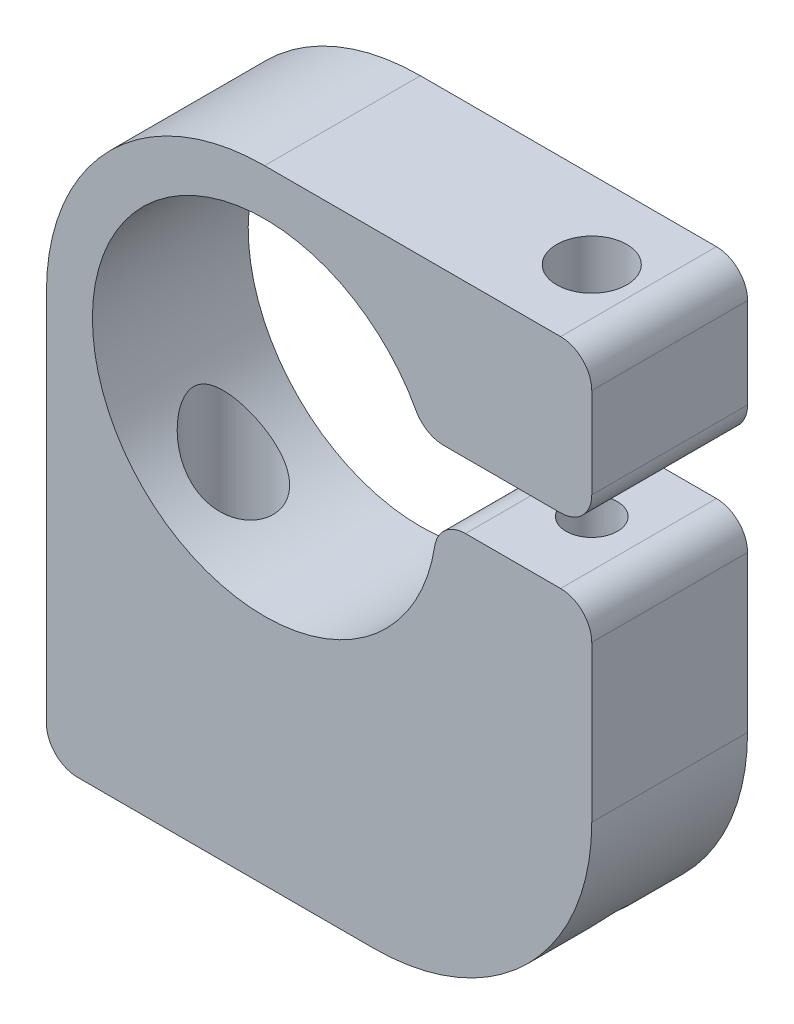
ISO-10303-21;
HEADER;
FILE_DESCRIPTION(('STEP AP214'),'2;1');
FILE_NAME('part.step','',(''),(''),'','','');
FILE_SCHEMA(('AUTOMOTIVE_DESIGN { 1 0 10303 214 1 1 1 1 }'));
ENDSEC;
DATA;
#1=APPLICATION_CONTEXT('core data for automotive mechanical design processes');
#2=APPLICATION_PROTOCOL_DEFINITION('international standard','automotive_design',2000,#1);
#3=PRODUCT_CONTEXT('',#1,'mechanical');
#4=PRODUCT('Part','Part','',(#3));
#5=PRODUCT_RELATED_PRODUCT_CATEGORY('part','',(#4));
#6=PRODUCT_DEFINITION_FORMATION('','',#4);
#7=PRODUCT_DEFINITION_CONTEXT('part definition',#1,'design');
#8=PRODUCT_DEFINITION('design','',#6,#7);
#9=PRODUCT_DEFINITION_SHAPE('','',#8);
#10=(LENGTH_UNIT() NAMED_UNIT(*) SI_UNIT(.MILLI.,.METRE.));
#11=(NAMED_UNIT(*) PLANE_ANGLE_UNIT() SI_UNIT($,.RADIAN.));
#12=(NAMED_UNIT(*) SI_UNIT($,.STERADIAN.) SOLID_ANGLE_UNIT());
#13=UNCERTAINTY_MEASURE_WITH_UNIT(LENGTH_MEASURE(1.E-05),#10,'distance_accuracy_value','');
#14=(GEOMETRIC_REPRESENTATION_CONTEXT(3) GLOBAL_UNCERTAINTY_ASSIGNED_CONTEXT((#13)) GLOBAL_UNIT_ASSIGNED_CONTEXT((#10,
#11,#12)) REPRESENTATION_CONTEXT('',''));
#15=CARTESIAN_POINT('',(0.,0.,0.));
#16=DIRECTION('',(0.,0.,1.));
#17=DIRECTION('',(1.,0.,0.));
#18=AXIS2_PLACEMENT_3D('',#15,#16,#17);
#19=CARTESIAN_POINT('',(-14.,-26.,10.));
#20=DIRECTION('',(0.,1.,0.));
#21=DIRECTION('',(-1.,0.,0.));
#22=AXIS2_PLACEMENT_3D('',#19,#20,#21);
#23=PLANE('',#22);
#24=DIRECTION('',(1.,0.,0.));
#25=VECTOR('',#24,1.);
#26=CARTESIAN_POINT('',(-14.,-26.,10.));
#27=LINE('',#26,#25);
#28=CARTESIAN_POINT('',(-12.,-26.,10.));
#29=VERTEX_POINT('',#28);
#30=CARTESIAN_POINT('',(7.,-26.,10.));
#31=VERTEX_POINT('',#30);
#32=EDGE_CURVE('E182',#29,#31,#27,.T.);
#33=ORIENTED_EDGE('',*,*,#32,.F.);
#34=DIRECTION('',(0.,0.,-1.));
#35=VECTOR('',#34,1.);
#36=CARTESIAN_POINT('',(-12.,-26.,10.));
#37=LINE('',#36,#35);
#38=CARTESIAN_POINT('',(-12.,-26.,0.));
#39=VERTEX_POINT('',#38);
#40=EDGE_CURVE('E174',#29,#39,#37,.T.);
#41=ORIENTED_EDGE('',*,*,#40,.T.);
#42=DIRECTION('',(1.,0.,0.));
#43=VECTOR('',#42,1.);
#44=CARTESIAN_POINT('',(-14.,-26.,0.));
#45=LINE('',#44,#43);
#46=CARTESIAN_POINT('',(7.,-26.,0.));
#47=VERTEX_POINT('',#46);
#48=EDGE_CURVE('E210',#39,#47,#45,.T.);
#49=ORIENTED_EDGE('',*,*,#48,.T.);
#50=DIRECTION('',(0.,0.,-1.));
#51=VECTOR('',#50,1.);
#52=CARTESIAN_POINT('',(7.,-26.,10.));
#53=LINE('',#52,#51);
#54=EDGE_CURVE('E222',#31,#47,#53,.T.);
#55=ORIENTED_EDGE('',*,*,#54,.F.);
#56=EDGE_LOOP('',(#33,#41,#49,#55));
#57=FACE_BOUND('',#56,.T.);
#58=CARTESIAN_POINT('',(-7.,-26.,5.));
#59=DIRECTION('',(0.,-1.,0.));
#60=DIRECTION('',(0.,0.,-1.));
#61=AXIS2_PLACEMENT_3D('',#58,#59,#60);
#62=CIRCLE('',#61,2.55269999999999);
#63=CARTESIAN_POINT('',(-7.,-26.,2.44730000000001));
#64=VERTEX_POINT('',#63);
#65=EDGE_CURVE('E409',#64,#64,#62,.T.);
#66=ORIENTED_EDGE('',*,*,#65,.F.);
#67=EDGE_LOOP('',(#66));
#68=FACE_BOUND('',#67,.T.);
#69=ADVANCED_FACE('F38',(#57,#68),#23,.F.);
#70=CARTESIAN_POINT('',(0.,14.,10.));
#71=DIRECTION('',(0.,-1.,0.));
#72=DIRECTION('',(0.,0.,-1.));
#73=AXIS2_PLACEMENT_3D('',#70,#71,#72);
#74=PLANE('',#73);
#75=DIRECTION('',(-1.,0.,0.));
#76=VECTOR('',#75,1.);
#77=CARTESIAN_POINT('',(0.,14.,10.));
#78=LINE('',#77,#76);
#79=CARTESIAN_POINT('',(19.,14.,10.));
#80=VERTEX_POINT('',#79);
#81=CARTESIAN_POINT('',(0.,14.,10.));
#82=VERTEX_POINT('',#81);
#83=EDGE_CURVE('E151',#80,#82,#78,.T.);
#84=ORIENTED_EDGE('',*,*,#83,.F.);
#85=DIRECTION('',(0.,0.,-1.));
#86=VECTOR('',#85,1.);
#87=CARTESIAN_POINT('',(19.,14.,10.));
#88=LINE('',#87,#86);
#89=CARTESIAN_POINT('',(19.,14.,0.));
#90=VERTEX_POINT('',#89);
#91=EDGE_CURVE('E335',#80,#90,#88,.T.);
#92=ORIENTED_EDGE('',*,*,#91,.T.);
#93=DIRECTION('',(-1.,0.,0.));
#94=VECTOR('',#93,1.);
#95=CARTESIAN_POINT('',(0.,14.,0.));
#96=LINE('',#95,#94);
#97=CARTESIAN_POINT('',(0.,14.,0.));
#98=VERTEX_POINT('',#97);
#99=EDGE_CURVE('E171',#90,#98,#96,.T.);
#100=ORIENTED_EDGE('',*,*,#99,.T.);
#101=DIRECTION('',(0.,0.,-1.));
#102=VECTOR('',#101,1.);
#103=CARTESIAN_POINT('',(0.,14.,10.));
#104=LINE('',#103,#102);
#105=EDGE_CURVE('E167',#82,#98,#104,.T.);
#106=ORIENTED_EDGE('',*,*,#105,.F.);
#107=EDGE_LOOP('',(#84,#92,#100,#106));
#108=FACE_BOUND('',#107,.T.);
#109=CARTESIAN_POINT('',(16.,14.,5.));
#110=DIRECTION('',(0.,1.,0.));
#111=DIRECTION('',(0.,0.,1.));
#112=AXIS2_PLACEMENT_3D('',#109,#110,#111);
#113=CIRCLE('',#112,2.24999999999999);
#114=CARTESIAN_POINT('',(16.,14.,7.24999999999999));
#115=VERTEX_POINT('',#114);
#116=EDGE_CURVE('E233',#115,#115,#113,.T.);
#117=ORIENTED_EDGE('',*,*,#116,.F.);
#118=EDGE_LOOP('',(#117));
#119=FACE_BOUND('',#118,.T.);
#120=ADVANCED_FACE('F168',(#108,#119),#74,.F.);
#121=CARTESIAN_POINT('',(0.,0.,10.));
#122=DIRECTION('',(0.,0.,-1.));
#123=DIRECTION('',(-1.,0.,0.));
#124=AXIS2_PLACEMENT_3D('',#121,#122,#123);
#125=CYLINDRICAL_SURFACE('',#124,11.05);
#126=CARTESIAN_POINT('',(-7.,-8.55,2.44730000000001));
#127=CARTESIAN_POINT('',(-6.91582227338061,-8.61891828092929,2.44730021930321));
#128=CARTESIAN_POINT('',(-6.83062757103432,-8.68658699889326,2.45146234715399));
#129=CARTESIAN_POINT('',(-6.65885844341236,-8.81894832773256,2.4687261767411));
#130=CARTESIAN_POINT('',(-6.57228447592739,-8.88364189947576,2.48182497029568));
#131=CARTESIAN_POINT('',(-6.3986080535741,-9.00953967894818,2.51757036820023));
#132=CARTESIAN_POINT('',(-6.3115058850438,-9.07074561769593,2.54021218836283));
#133=CARTESIAN_POINT('',(-6.13784335694778,-9.18914768532718,2.59557241929037));
#134=CARTESIAN_POINT('',(-6.05128276573991,-9.2463456529749,2.6282861716356));
#135=CARTESIAN_POINT('',(-5.84259248200227,-9.38018480640999,2.72080110255312));
#136=CARTESIAN_POINT('',(-5.72135326767104,-9.45447301355489,2.78619561321113));
#137=CARTESIAN_POINT('',(-5.48710248455832,-9.59232513224943,2.93918277873381));
#138=CARTESIAN_POINT('',(-5.37408534080165,-9.65589634971606,3.02676020844699));
#139=CARTESIAN_POINT('',(-5.16072212371146,-9.77160560888942,3.22389980728585));
#140=CARTESIAN_POINT('',(-5.0604506762834,-9.82367752342953,3.33358253091881));
#141=CARTESIAN_POINT('',(-4.87867755337641,-9.91521124980694,3.57215994244326));
#142=CARTESIAN_POINT('',(-4.79717043001752,-9.9546767229878,3.70104903616756));
#143=CARTESIAN_POINT('',(-4.66444990013896,-10.0174987368244,3.9604812249715));
#144=CARTESIAN_POINT('',(-4.611046451206,-10.0420572971666,4.08961673616397));
#145=CARTESIAN_POINT('',(-4.52583543818812,-10.0807503937009,4.35629465045988));
#146=CARTESIAN_POINT('',(-4.49401982510529,-10.0948888151986,4.49383389936745));
#147=CARTESIAN_POINT('',(-4.45464254131906,-10.1123238524974,4.76511458296565));
#148=CARTESIAN_POINT('',(-4.44582659487551,-10.1161814048369,4.89863970576941));
#149=CARTESIAN_POINT('',(-4.44917462901911,-10.1147096597553,5.16536543958354));
#150=CARTESIAN_POINT('',(-4.46133533829391,-10.1093817948013,5.29856609795018));
#151=CARTESIAN_POINT('',(-4.50578803655468,-10.0896453817462,5.55891009600437));
#152=CARTESIAN_POINT('',(-4.53779375226787,-10.0753659325654,5.68611236277468));
#153=CARTESIAN_POINT('',(-4.62032539498195,-10.0377853303976,5.93293024560929));
#154=CARTESIAN_POINT('',(-4.67085096260623,-10.0144843524722,6.05254600883639));
#155=CARTESIAN_POINT('',(-4.78909182279992,-9.95848444657918,6.28261833109357));
#156=CARTESIAN_POINT('',(-4.85702410909894,-9.92566613883106,6.39293400598795));
#157=CARTESIAN_POINT('',(-5.00691855343983,-9.85090169234285,6.60008100643447));
#158=CARTESIAN_POINT('',(-5.08888261614623,-9.80895431421851,6.69691049814028));
#159=CARTESIAN_POINT('',(-5.26778917821294,-9.71409279963231,6.87958270744378));
#160=CARTESIAN_POINT('',(-5.36525732003787,-9.66075326084558,6.96468760788155));
#161=CARTESIAN_POINT('',(-5.5683128171784,-9.54515843513311,7.11723804954233));
#162=CARTESIAN_POINT('',(-5.67390214087097,-9.48290098354882,7.18467929196429));
#163=CARTESIAN_POINT('',(-5.90047685231445,-9.34377960210155,7.30771661305881));
#164=CARTESIAN_POINT('',(-6.02194816668489,-9.26607844806306,7.36146362377749));
#165=CARTESIAN_POINT('',(-6.26661487830976,-9.10240593239786,7.44853562475557));
#166=CARTESIAN_POINT('',(-6.38981168508661,-9.01642742637117,7.48184278666938));
#167=CARTESIAN_POINT('',(-6.68729766332038,-8.79938837781169,7.53973292496556));
#168=CARTESIAN_POINT('',(-6.86091961227399,-8.66476534579487,7.55450318352895));
#169=CARTESIAN_POINT('',(-7.19943550850972,-8.38564269357662,7.55054006637053));
#170=CARTESIAN_POINT('',(-7.36432097278999,-8.241133775255,7.53177472039414));
#171=CARTESIAN_POINT('',(-7.68414769569538,-7.94384691266525,7.4648068548412));
#172=CARTESIAN_POINT('',(-7.83892408316011,-7.79098349947186,7.41620920043142));
#173=CARTESIAN_POINT('',(-8.13453173744894,-7.48182597649256,7.29235550809219));
#174=CARTESIAN_POINT('',(-8.27532669370793,-7.32552415852656,7.21703226611901));
#175=CARTESIAN_POINT('',(-8.48957492483989,-7.07427779779615,7.07531747375102));
#176=CARTESIAN_POINT('',(-8.56797995603815,-6.97902972810029,7.01677740008713));
#177=CARTESIAN_POINT('',(-8.71863027937125,-6.78988840431592,6.89005025630064));
#178=CARTESIAN_POINT('',(-8.79087114978904,-6.69599616224703,6.82185635293331));
#179=CARTESIAN_POINT('',(-8.92830276124916,-6.51161059184213,6.67569346560714));
#180=CARTESIAN_POINT('',(-8.99352479554179,-6.42110346016955,6.59777152811136));
#181=CARTESIAN_POINT('',(-9.11643655558932,-6.2453601356915,6.43097851812366));
#182=CARTESIAN_POINT('',(-9.17413846494606,-6.16011553787112,6.34212562103501));
#183=CARTESIAN_POINT('',(-9.26650263943499,-6.01992555464292,6.17713277247053));
#184=CARTESIAN_POINT('',(-9.30321342581972,-5.96294677193365,6.10388570170611));
#185=CARTESIAN_POINT('',(-9.37091023318427,-5.85598319569889,5.94981271437577));
#186=CARTESIAN_POINT('',(-9.40189341278976,-5.80600187647093,5.86898306602609));
#187=CARTESIAN_POINT('',(-9.45704052062065,-5.71574328017512,5.69813905099871));
#188=CARTESIAN_POINT('',(-9.48110233302485,-5.67561248462582,5.60801142498912));
#189=CARTESIAN_POINT('',(-9.51962893314093,-5.6107603174239,5.42048096383256));
#190=CARTESIAN_POINT('',(-9.53412688491903,-5.58598571420402,5.32310458635426));
#191=CARTESIAN_POINT('',(-9.54927357137649,-5.56003844308443,5.15107964124371));
#192=CARTESIAN_POINT('',(-9.55259565720213,-5.55431466774299,5.07734886713659));
#193=CARTESIAN_POINT('',(-9.55279927475475,-5.55396532930258,4.92984497289981));
#194=CARTESIAN_POINT('',(-9.5496816032385,-5.55933839325096,4.85607185913761));
#195=CARTESIAN_POINT('',(-9.53732309052223,-5.58051133249627,4.71092422137441));
#196=CARTESIAN_POINT('',(-9.52810667830438,-5.59626960799627,4.63954131681787));
#197=CARTESIAN_POINT('',(-9.50430624388253,-5.63659549260418,4.50026721442244));
#198=CARTESIAN_POINT('',(-9.48971751535205,-5.66117082525817,4.43237913778262));
#199=CARTESIAN_POINT('',(-9.44579705695876,-5.73429557275425,4.26090575121788));
#200=CARTESIAN_POINT('',(-9.4128877208385,-5.7883500232898,4.16060531557813));
#201=CARTESIAN_POINT('',(-9.33823866932467,-5.90802801501698,3.97073003865575));
#202=CARTESIAN_POINT('',(-9.2964707266068,-5.97368842362166,3.8811909515325));
#203=CARTESIAN_POINT('',(-9.21231919737082,-6.10252055153487,3.72379122107621));
#204=CARTESIAN_POINT('',(-9.17084356190511,-6.16474972776025,3.65465142351575));
#205=CARTESIAN_POINT('',(-9.08340501241976,-6.29287480515179,3.52285353776865));
#206=CARTESIAN_POINT('',(-9.03743894994673,-6.35877326490362,3.4602000617762));
#207=CARTESIAN_POINT('',(-8.9414062953461,-6.49311856814282,3.34075325452514));
#208=CARTESIAN_POINT('',(-8.89133185005283,-6.56157014904866,3.28397163848765));
#209=CARTESIAN_POINT('',(-8.78744798055969,-6.70005658777117,3.17601591523038));
#210=CARTESIAN_POINT('',(-8.73363759506631,-6.77009184993509,3.1248432600504));
#211=CARTESIAN_POINT('',(-8.60244306329082,-6.93652511015039,3.01039470720596));
#212=CARTESIAN_POINT('',(-8.52355597708609,-7.03332160347713,2.94940956694815));
#213=CARTESIAN_POINT('',(-8.35961023785898,-7.22741815906888,2.83722340193677));
#214=CARTESIAN_POINT('',(-8.27454892065696,-7.32471842169038,2.78602663590866));
#215=CARTESIAN_POINT('',(-8.09884148477037,-7.51853212462236,2.6937823022661));
#216=CARTESIAN_POINT('',(-8.00821196226968,-7.61504701661814,2.65270624381435));
#217=CARTESIAN_POINT('',(-7.82150872449019,-7.806689039355,2.58103407259278));
#218=CARTESIAN_POINT('',(-7.72543564048604,-7.90181632941012,2.5504367475206));
#219=CARTESIAN_POINT('',(-7.5270730715576,-8.09102521976024,2.50018625397325));
#220=CARTESIAN_POINT('',(-7.42472118659406,-8.18507914771044,2.48067376912764));
#221=CARTESIAN_POINT('',(-7.21547961375136,-8.37011703082066,2.45422484046178));
#222=CARTESIAN_POINT('',(-7.10858592951042,-8.46109815035985,2.44729971710758));
#223=CARTESIAN_POINT('',(-7.,-8.55,2.44730000000001));
#224=B_SPLINE_CURVE_WITH_KNOTS('',3,(#126,#127,#128,#129,#130,#131,#132,#133,#134,#135,#136,
#137,#138,#139,#140,#141,#142,#143,#144,#145,#146,#147,#148,#149,#150,#151,#152,#153,#154,#155,
#156,#157,#158,#159,#160,#161,#162,#163,#164,#165,#166,#167,#168,#169,#170,#171,#172,#173,#174,
#175,#176,#177,#178,#179,#180,#181,#182,#183,#184,#185,#186,#187,#188,#189,#190,#191,#192,#193,
#194,#195,#196,#197,#198,#199,#200,#201,#202,#203,#204,#205,#206,#207,#208,#209,#210,#211,#212,
#213,#214,#215,#216,#217,#218,#219,#220,#221,#222,#223),.UNSPECIFIED.,.T.,.F.,(4,2,2,2,2,2,2,2,
2,2,2,2,2,2,2,2,2,2,2,2,2,2,2,2,2,2,2,2,2,2,2,2,2,2,2,2,2,2,2,2,2,2,2,2,2,2,2,2,4),(0.,
0.326260761406683,0.65241540120872,0.978406724649654,1.30424749814308,1.77169449077878,
2.23882151842664,2.7085686030106,3.17817913259791,3.60163469955728,4.02493229474726,
4.42461053592038,4.8242264528516,5.21820769638648,5.61218129514414,6.01132784405462,
6.41052861588882,6.82864143584349,7.24685591748099,7.70672889132275,8.16700241432437,
8.82399382588616,9.4816118964522,10.1481340198454,10.8163441955908,11.2255925001434,
11.6351319438537,12.0427623941947,12.4497239943351,12.7485793995887,13.0475826667011,
13.3507942849023,13.6529488674638,13.8739736331243,14.0949710542095,14.3150885683233,
14.5353993731607,14.8891544241882,15.2440540965731,15.5491782562871,15.8545179099744,
16.1604554616674,16.4664720279053,16.8828515600978,17.299411840474,17.714785707201,
18.130111502378,18.5505969700523,18.9714604153234),.UNSPECIFIED.);
#225=CARTESIAN_POINT('',(-7.,-8.55,2.44730000000001));
#226=VERTEX_POINT('',#225);
#227=EDGE_CURVE('E404',#226,#226,#224,.T.);
#228=ORIENTED_EDGE('',*,*,#227,.T.);
#229=EDGE_LOOP('',(#228));
#230=FACE_BOUND('',#229,.T.);
#231=CARTESIAN_POINT('',(0.,0.,10.));
#232=DIRECTION('',(0.,0.,-1.));
#233=DIRECTION('',(1.,0.,0.));
#234=AXIS2_PLACEMENT_3D('',#231,#232,#233);
#235=CIRCLE('',#234,11.05);
#236=CARTESIAN_POINT('',(10.9194598387173,-1.69348659003832,10.));
#237=VERTEX_POINT('',#236);
#238=CARTESIAN_POINT('',(9.72327164371918,5.24980842911877,10.));
#239=VERTEX_POINT('',#238);
#240=EDGE_CURVE('E219',#237,#239,#235,.T.);
#241=ORIENTED_EDGE('',*,*,#240,.F.);
#242=DIRECTION('',(0.,0.,-1.));
#243=VECTOR('',#242,1.);
#244=CARTESIAN_POINT('',(10.9194598387173,-1.69348659003832,10.));
#245=LINE('',#244,#243);
#246=CARTESIAN_POINT('',(10.9194598387173,-1.69348659003832,0.));
#247=VERTEX_POINT('',#246);
#248=EDGE_CURVE('E11',#237,#247,#245,.T.);
#249=ORIENTED_EDGE('',*,*,#248,.T.);
#250=CARTESIAN_POINT('',(0.,0.,0.));
#251=DIRECTION('',(0.,0.,-1.));
#252=DIRECTION('',(1.,0.,0.));
#253=AXIS2_PLACEMENT_3D('',#250,#251,#252);
#254=CIRCLE('',#253,11.05);
#255=CARTESIAN_POINT('',(9.72327164371918,5.24980842911877,0.));
#256=VERTEX_POINT('',#255);
#257=EDGE_CURVE('E194',#247,#256,#254,.T.);
#258=ORIENTED_EDGE('',*,*,#257,.T.);
#259=DIRECTION('',(0.,0.,-1.));
#260=VECTOR('',#259,1.);
#261=CARTESIAN_POINT('',(9.72327164371918,5.24980842911877,10.));
#262=LINE('',#261,#260);
#263=EDGE_CURVE('E46',#256,#239,#262,.F.);
#264=ORIENTED_EDGE('',*,*,#263,.T.);
#265=EDGE_LOOP('',(#241,#249,#258,#264));
#266=FACE_BOUND('',#265,.T.);
#267=ADVANCED_FACE('F275',(#230,#266),#125,.F.);
#268=CARTESIAN_POINT('',(10.2206898005957,4.2,10.));
#269=DIRECTION('',(0.,1.,0.));
#270=DIRECTION('',(0.,0.,1.));
#271=AXIS2_PLACEMENT_3D('',#268,#269,#270);
#272=PLANE('',#271);
#273=CARTESIAN_POINT('',(16.,4.2,5.));
#274=DIRECTION('',(0.,1.,0.));
#275=DIRECTION('',(0.,0.,1.));
#276=AXIS2_PLACEMENT_3D('',#273,#274,#275);
#277=CIRCLE('',#276,2.24999999999999);
#278=CARTESIAN_POINT('',(16.,4.2,7.24999999999999));
#279=VERTEX_POINT('',#278);
#280=EDGE_CURVE('E198',#279,#279,#277,.T.);
#281=ORIENTED_EDGE('',*,*,#280,.T.);
#282=EDGE_LOOP('',(#281));
#283=FACE_BOUND('',#282,.T.);
#284=DIRECTION('',(1.,0.,0.));
#285=VECTOR('',#284,1.);
#286=CARTESIAN_POINT('',(10.2206898005957,4.2,0.));
#287=LINE('',#286,#285);
#288=CARTESIAN_POINT('',(11.4831398145281,4.2,0.));
#289=VERTEX_POINT('',#288);
#290=CARTESIAN_POINT('',(19.,4.2,0.));
#291=VERTEX_POINT('',#290);
#292=EDGE_CURVE('E197',#289,#291,#287,.T.);
#293=ORIENTED_EDGE('',*,*,#292,.T.);
#294=DIRECTION('',(0.,0.,-1.));
#295=VECTOR('',#294,1.);
#296=CARTESIAN_POINT('',(19.,4.2,10.));
#297=LINE('',#296,#295);
#298=CARTESIAN_POINT('',(19.,4.2,10.));
#299=VERTEX_POINT('',#298);
#300=EDGE_CURVE('E345',#291,#299,#297,.F.);
#301=ORIENTED_EDGE('',*,*,#300,.T.);
#302=DIRECTION('',(1.,0.,0.));
#303=VECTOR('',#302,1.);
#304=CARTESIAN_POINT('',(10.2206898005957,4.2,10.));
#305=LINE('',#304,#303);
#306=CARTESIAN_POINT('',(11.4831398145281,4.2,10.));
#307=VERTEX_POINT('',#306);
#308=EDGE_CURVE('E358',#307,#299,#305,.T.);
#309=ORIENTED_EDGE('',*,*,#308,.F.);
#310=DIRECTION('',(0.,0.,-1.));
#311=VECTOR('',#310,1.);
#312=CARTESIAN_POINT('',(11.4831398145281,4.2,10.));
#313=LINE('',#312,#311);
#314=EDGE_CURVE('E342',#307,#289,#313,.T.);
#315=ORIENTED_EDGE('',*,*,#314,.T.);
#316=EDGE_LOOP('',(#293,#301,#309,#315));
#317=FACE_BOUND('',#316,.T.);
#318=ADVANCED_FACE('F288',(#283,#317),#272,.F.);
#319=CARTESIAN_POINT('',(21.,14.,10.));
#320=DIRECTION('',(-1.,0.,0.));
#321=DIRECTION('',(0.,0.,1.));
#322=AXIS2_PLACEMENT_3D('',#319,#320,#321);
#323=PLANE('',#322);
#324=DIRECTION('',(0.,1.,0.));
#325=VECTOR('',#324,1.);
#326=CARTESIAN_POINT('',(21.,14.,0.));
#327=LINE('',#326,#325);
#328=CARTESIAN_POINT('',(21.,6.2,0.));
#329=VERTEX_POINT('',#328);
#330=CARTESIAN_POINT('',(21.,12.,0.));
#331=VERTEX_POINT('',#330);
#332=EDGE_CURVE('E201',#329,#331,#327,.T.);
#333=ORIENTED_EDGE('',*,*,#332,.T.);
#334=DIRECTION('',(0.,0.,-1.));
#335=VECTOR('',#334,1.);
#336=CARTESIAN_POINT('',(21.,12.,10.));
#337=LINE('',#336,#335);
#338=CARTESIAN_POINT('',(21.,12.,10.));
#339=VERTEX_POINT('',#338);
#340=EDGE_CURVE('E340',#331,#339,#337,.F.);
#341=ORIENTED_EDGE('',*,*,#340,.T.);
#342=DIRECTION('',(0.,1.,0.));
#343=VECTOR('',#342,1.);
#344=CARTESIAN_POINT('',(21.,14.,10.));
#345=LINE('',#344,#343);
#346=CARTESIAN_POINT('',(21.,6.2,10.));
#347=VERTEX_POINT('',#346);
#348=EDGE_CURVE('E164',#347,#339,#345,.T.);
#349=ORIENTED_EDGE('',*,*,#348,.F.);
#350=DIRECTION('',(0.,0.,-1.));
#351=VECTOR('',#350,1.);
#352=CARTESIAN_POINT('',(21.,6.2,10.));
#353=LINE('',#352,#351);
#354=EDGE_CURVE('E337',#347,#329,#353,.T.);
#355=ORIENTED_EDGE('',*,*,#354,.T.);
#356=EDGE_LOOP('',(#333,#341,#349,#355));
#357=FACE_BOUND('',#356,.T.);
#358=ADVANCED_FACE('F284',(#357),#323,.F.);
#359=CARTESIAN_POINT('',(0.,0.,10.));
#360=DIRECTION('',(0.,0.,-1.));
#361=DIRECTION('',(-1.,0.,0.));
#362=AXIS2_PLACEMENT_3D('',#359,#360,#361);
#363=CYLINDRICAL_SURFACE('',#362,14.);
#364=CARTESIAN_POINT('',(0.,0.,0.));
#365=DIRECTION('',(0.,0.,1.));
#366=DIRECTION('',(1.,0.,0.));
#367=AXIS2_PLACEMENT_3D('',#364,#365,#366);
#368=CIRCLE('',#367,14.);
#369=CARTESIAN_POINT('',(-14.,0.,0.));
#370=VERTEX_POINT('',#369);
#371=EDGE_CURVE('E205',#98,#370,#368,.T.);
#372=ORIENTED_EDGE('',*,*,#371,.T.);
#373=DIRECTION('',(0.,0.,-1.));
#374=VECTOR('',#373,1.);
#375=CARTESIAN_POINT('',(-14.,0.,10.));
#376=LINE('',#375,#374);
#377=CARTESIAN_POINT('',(-14.,0.,10.));
#378=VERTEX_POINT('',#377);
#379=EDGE_CURVE('E175',#378,#370,#376,.T.);
#380=ORIENTED_EDGE('',*,*,#379,.F.);
#381=CARTESIAN_POINT('',(0.,0.,10.));
#382=DIRECTION('',(0.,0.,1.));
#383=DIRECTION('',(1.,0.,0.));
#384=AXIS2_PLACEMENT_3D('',#381,#382,#383);
#385=CIRCLE('',#384,14.);
#386=EDGE_CURVE('E156',#82,#378,#385,.T.);
#387=ORIENTED_EDGE('',*,*,#386,.F.);
#388=ORIENTED_EDGE('',*,*,#105,.T.);
#389=EDGE_LOOP('',(#372,#380,#387,#388));
#390=FACE_BOUND('',#389,.T.);
#391=ADVANCED_FACE('F177',(#390),#363,.T.);
#392=CARTESIAN_POINT('',(-14.,0.,10.));
#393=DIRECTION('',(1.,0.,0.));
#394=DIRECTION('',(0.,1.,0.));
#395=AXIS2_PLACEMENT_3D('',#392,#393,#394);
#396=PLANE('',#395);
#397=DIRECTION('',(0.,-1.,0.));
#398=VECTOR('',#397,1.);
#399=CARTESIAN_POINT('',(-14.,0.,0.));
#400=LINE('',#399,#398);
#401=CARTESIAN_POINT('',(-14.,-24.,0.));
#402=VERTEX_POINT('',#401);
#403=EDGE_CURVE('E207',#370,#402,#400,.T.);
#404=ORIENTED_EDGE('',*,*,#403,.T.);
#405=DIRECTION('',(0.,0.,-1.));
#406=VECTOR('',#405,1.);
#407=CARTESIAN_POINT('',(-14.,-24.,10.));
#408=LINE('',#407,#406);
#409=CARTESIAN_POINT('',(-14.,-24.,10.));
#410=VERTEX_POINT('',#409);
#411=EDGE_CURVE('E327',#402,#410,#408,.F.);
#412=ORIENTED_EDGE('',*,*,#411,.T.);
#413=DIRECTION('',(0.,-1.,0.));
#414=VECTOR('',#413,1.);
#415=CARTESIAN_POINT('',(-14.,0.,10.));
#416=LINE('',#415,#414);
#417=EDGE_CURVE('E180',#378,#410,#416,.T.);
#418=ORIENTED_EDGE('',*,*,#417,.F.);
#419=ORIENTED_EDGE('',*,*,#379,.T.);
#420=EDGE_LOOP('',(#404,#412,#418,#419));
#421=FACE_BOUND('',#420,.T.);
#422=ADVANCED_FACE('F268',(#421),#396,.F.);
#423=CARTESIAN_POINT('',(7.,-12.,10.));
#424=DIRECTION('',(0.,0.,-1.));
#425=DIRECTION('',(-1.,0.,0.));
#426=AXIS2_PLACEMENT_3D('',#423,#424,#425);
#427=CYLINDRICAL_SURFACE('',#426,14.);
#428=CARTESIAN_POINT('',(16.,-22.7238052947636,6.64999999999999));
#429=CARTESIAN_POINT('',(16.106579995657,-22.6343528788209,6.64999937148087));
#430=CARTESIAN_POINT('',(16.2119257461119,-22.5432118765201,6.63967861318019));
#431=CARTESIAN_POINT('',(16.4180467313716,-22.3595182425853,6.59963227004351));
#432=CARTESIAN_POINT('',(16.5188040136965,-22.2669616914375,6.56983647814548));
#433=CARTESIAN_POINT('',(16.7296204153312,-22.0677029799706,6.48495127735594));
#434=CARTESIAN_POINT('',(16.838534085899,-21.9611437664043,6.42654086662092));
#435=CARTESIAN_POINT('',(16.9925416717458,-21.8058394712143,6.31956531374991));
#436=CARTESIAN_POINT('',(17.0422908469139,-21.7548554447352,6.28070833711339));
#437=CARTESIAN_POINT('',(17.1381930128919,-21.6551438139479,6.19628381873392));
#438=CARTESIAN_POINT('',(17.1843487882394,-21.6064144745977,6.15072155369636));
#439=CARTESIAN_POINT('',(17.2783623633107,-21.505820560723,6.04589745921177));
#440=CARTESIAN_POINT('',(17.3256017274291,-21.4544273622782,5.98561567077288));
#441=CARTESIAN_POINT('',(17.4130229101965,-21.3580538185622,5.85556197975288));
#442=CARTESIAN_POINT('',(17.4532162560941,-21.3130630221341,5.78580591529059));
#443=CARTESIAN_POINT('',(17.5168278214362,-21.2411110596542,5.65264859046648));
#444=CARTESIAN_POINT('',(17.5419954205956,-21.2123513694785,5.59107061879283));
#445=CARTESIAN_POINT('',(17.585301804171,-21.1625584802104,5.46250049247954));
#446=CARTESIAN_POINT('',(17.6034459883031,-21.1415193460781,5.39551254520185));
#447=CARTESIAN_POINT('',(17.6314476646167,-21.1089406996459,5.25676296801894));
#448=CARTESIAN_POINT('',(17.6412187369708,-21.0975002814021,5.18495961288801));
#449=CARTESIAN_POINT('',(17.6511178429677,-21.0859098208405,5.03980664908665));
#450=CARTESIAN_POINT('',(17.6512551491392,-21.0857489219516,4.96645859523165));
#451=CARTESIAN_POINT('',(17.6426376062661,-21.0958389663479,4.83256517356608));
#452=CARTESIAN_POINT('',(17.6352567218856,-21.1044811347259,4.77179643157314));
#453=CARTESIAN_POINT('',(17.6142055671432,-21.1290142083835,4.65288206187813));
#454=CARTESIAN_POINT('',(17.6005320775243,-21.1449088239337,4.59473779357945));
#455=CARTESIAN_POINT('',(17.5624508106396,-21.1888909447278,4.46404308010366));
#456=CARTESIAN_POINT('',(17.5360064105836,-21.2192544144082,4.3928576980767));
#457=CARTESIAN_POINT('',(17.4755622207263,-21.2878789044817,4.25790011605861));
#458=CARTESIAN_POINT('',(17.4415472331647,-21.3261557997266,4.19414322642238));
#459=CARTESIAN_POINT('',(17.3516546333627,-21.4259985314055,4.04831655959411));
#460=CARTESIAN_POINT('',(17.2926701141167,-21.490495157725,3.97018382795625));
#461=CARTESIAN_POINT('',(17.1658023020504,-21.6262751411015,3.82847261657362));
#462=CARTESIAN_POINT('',(17.0979021974435,-21.6975712483798,3.7649222723929));
#463=CARTESIAN_POINT('',(16.9306282045901,-21.8692160310444,3.63199314975953));
#464=CARTESIAN_POINT('',(16.8284618473636,-21.9711225684204,3.56812840492811));
#465=CARTESIAN_POINT('',(16.6148392283032,-22.1772779488726,3.46423246623702));
#466=CARTESIAN_POINT('',(16.503375559846,-22.2815286101437,3.42422048523059));
#467=CARTESIAN_POINT('',(16.2725136876682,-22.4902307103248,3.36828871405738));
#468=CARTESIAN_POINT('',(16.1530454690731,-22.5946731177538,3.35262182383202));
#469=CARTESIAN_POINT('',(15.9102997798279,-22.7996148734929,3.34798619096338));
#470=CARTESIAN_POINT('',(15.7870273212754,-22.9001190446257,3.35898368585487));
#471=CARTESIAN_POINT('',(15.5683082068592,-23.0724434166654,3.40447682209039));
#472=CARTESIAN_POINT('',(15.4727686603442,-23.1456728306208,3.43320431295187));
#473=CARTESIAN_POINT('',(15.2848376247068,-23.2860598659466,3.5095979619181));
#474=CARTESIAN_POINT('',(15.1924421379826,-23.3532253920164,3.5572390142285));
#475=CARTESIAN_POINT('',(15.0303250024325,-23.4683034433074,3.66215117836996));
#476=CARTESIAN_POINT('',(14.9594782446716,-23.5175224394325,3.71624246384423));
#477=CARTESIAN_POINT('',(14.8252018301674,-23.6091693892466,3.83787167745971));
#478=CARTESIAN_POINT('',(14.7617708405492,-23.6515985638132,3.90540718328483));
#479=CARTESIAN_POINT('',(14.644995971895,-23.7285540646411,4.05372484201149));
#480=CARTESIAN_POINT('',(14.5917337644027,-23.763016837769,4.13460525460281));
#481=CARTESIAN_POINT('',(14.4992695054021,-23.8221823401396,4.307274701436));
#482=CARTESIAN_POINT('',(14.4600548170354,-23.8468938434667,4.39905383193368));
#483=CARTESIAN_POINT('',(14.4027709378073,-23.8827592103645,4.5770689462531));
#484=CARTESIAN_POINT('',(14.3825342307727,-23.8953109696735,4.66232922454683));
#485=CARTESIAN_POINT('',(14.3558550360406,-23.9118283349687,4.83577890948328));
#486=CARTESIAN_POINT('',(14.3494036687769,-23.9157994680218,4.92396639341754));
#487=CARTESIAN_POINT('',(14.3506264730563,-23.9150443225192,5.09217421626688));
#488=CARTESIAN_POINT('',(14.3570740049052,-23.9110733227628,5.17221073180531));
#489=CARTESIAN_POINT('',(14.3813397959637,-23.8960507929753,5.32984052704268));
#490=CARTESIAN_POINT('',(14.3991564194326,-23.8850002815159,5.4074341565296));
#491=CARTESIAN_POINT('',(14.4451782729215,-23.8562239414615,5.55785155767265));
#492=CARTESIAN_POINT('',(14.4733487279084,-23.8385204535525,5.63069034581051));
#493=CARTESIAN_POINT('',(14.5387817088008,-23.7969600737915,5.77025057906279));
#494=CARTESIAN_POINT('',(14.5760463018198,-23.7731017828715,5.8369706286268));
#495=CARTESIAN_POINT('',(14.6610769858981,-23.7179621514858,5.96761825304297));
#496=CARTESIAN_POINT('',(14.7094022679763,-23.6862729319695,6.03100783484434));
#497=CARTESIAN_POINT('',(14.812811523411,-23.6173937112617,6.14857366407959));
#498=CARTESIAN_POINT('',(14.8678977855172,-23.5802018464159,6.20274677663263));
#499=CARTESIAN_POINT('',(14.9906775601817,-23.4958825367302,6.30810999763578));
#500=CARTESIAN_POINT('',(15.0590735934271,-23.4480915506242,6.35794660865051));
#501=CARTESIAN_POINT('',(15.1999497072863,-23.3476133372229,6.44544422256679));
#502=CARTESIAN_POINT('',(15.2724334674585,-23.2949216699785,6.48309404331672));
#503=CARTESIAN_POINT('',(15.4329063596069,-23.175767946371,6.55237397116199));
#504=CARTESIAN_POINT('',(15.5213259970159,-23.1085403369733,6.58167863768683));
#505=CARTESIAN_POINT('',(15.6987021618737,-22.9701967243639,6.62482162473554));
#506=CARTESIAN_POINT('',(15.7876581212651,-22.8990843512463,6.63867413363013));
#507=CARTESIAN_POINT('',(15.9174707395229,-22.7926653857343,6.64846038537193));
#508=CARTESIAN_POINT('',(15.9588274645974,-22.7583613363504,6.65000024280096));
#509=CARTESIAN_POINT('',(16.,-22.7238052947636,6.64999999999999));
#510=B_SPLINE_CURVE_WITH_KNOTS('',3,(#428,#429,#430,#431,#432,#433,#434,#435,#436,#437,#438,
#439,#440,#441,#442,#443,#444,#445,#446,#447,#448,#449,#450,#451,#452,#453,#454,#455,#456,#457,
#458,#459,#460,#461,#462,#463,#464,#465,#466,#467,#468,#469,#470,#471,#472,#473,#474,#475,#476,
#477,#478,#479,#480,#481,#482,#483,#484,#485,#486,#487,#488,#489,#490,#491,#492,#493,#494,#495,
#496,#497,#498,#499,#500,#501,#502,#503,#504,#505,#506,#507,#508,#509),.UNSPECIFIED.,.T.,.F.,(4,
2,2,2,2,2,2,2,2,2,2,2,2,2,2,2,2,2,2,2,2,2,2,2,2,2,2,2,2,2,2,2,2,2,2,2,2,2,2,2,4),(0.,
0.417313624974774,0.836140015878179,1.32296089721767,1.56608888484299,1.80902655674804,
2.08491886679901,2.36035551850128,2.57698173153486,2.79344106643438,3.01210848279734,
3.23056542822633,3.41518674146972,3.59990261098669,3.84389778596581,4.08838726523621,
4.43816062529032,4.7886032748193,5.25958637148018,5.73094832341318,6.20717486613138,
6.68279872540552,7.05267387347715,7.42205968343826,7.72630485206907,8.03049525277731,
8.33703451641478,8.64329732703461,8.90740721526167,9.17134693074442,9.41137735393962,
9.65137325027696,9.89057033929166,10.1298218489503,10.3861262662991,10.6425176892374,
10.9329869020569,11.2237218881852,11.5671158037298,11.9101941503294,12.0714050782557),.UNSPECIFIED.);
#511=CARTESIAN_POINT('',(16.,-22.7238052947636,6.64999999999999));
#512=VERTEX_POINT('',#511);
#513=EDGE_CURVE('E226',#512,#512,#510,.T.);
#514=ORIENTED_EDGE('',*,*,#513,.T.);
#515=EDGE_LOOP('',(#514));
#516=FACE_BOUND('',#515,.T.);
#517=CARTESIAN_POINT('',(7.,-12.,0.));
#518=DIRECTION('',(0.,0.,1.));
#519=DIRECTION('',(1.,0.,0.));
#520=AXIS2_PLACEMENT_3D('',#517,#518,#519);
#521=CIRCLE('',#520,14.);
#522=CARTESIAN_POINT('',(21.,-12.,0.));
#523=VERTEX_POINT('',#522);
#524=EDGE_CURVE('E212',#47,#523,#521,.T.);
#525=ORIENTED_EDGE('',*,*,#524,.T.);
#526=DIRECTION('',(0.,0.,-1.));
#527=VECTOR('',#526,1.);
#528=CARTESIAN_POINT('',(21.,-12.,10.));
#529=LINE('',#528,#527);
#530=CARTESIAN_POINT('',(21.,-12.,10.));
#531=VERTEX_POINT('',#530);
#532=EDGE_CURVE('E193',#531,#523,#529,.T.);
#533=ORIENTED_EDGE('',*,*,#532,.F.);
#534=CARTESIAN_POINT('',(7.,-12.,10.));
#535=DIRECTION('',(0.,0.,1.));
#536=DIRECTION('',(1.,0.,0.));
#537=AXIS2_PLACEMENT_3D('',#534,#535,#536);
#538=CIRCLE('',#537,14.);
#539=EDGE_CURVE('E187',#31,#531,#538,.T.);
#540=ORIENTED_EDGE('',*,*,#539,.F.);
#541=ORIENTED_EDGE('',*,*,#54,.T.);
#542=EDGE_LOOP('',(#525,#533,#540,#541));
#543=FACE_BOUND('',#542,.T.);
#544=ADVANCED_FACE('F236',(#516,#543),#427,.T.);
#545=CARTESIAN_POINT('',(21.,0.,10.));
#546=DIRECTION('',(-1.,0.,0.));
#547=DIRECTION('',(0.,0.,1.));
#548=AXIS2_PLACEMENT_3D('',#545,#546,#547);
#549=PLANE('',#548);
#550=DIRECTION('',(0.,1.,0.));
#551=VECTOR('',#550,1.);
#552=CARTESIAN_POINT('',(21.,0.,0.));
#553=LINE('',#552,#551);
#554=CARTESIAN_POINT('',(21.,-2.,0.));
#555=VERTEX_POINT('',#554);
#556=EDGE_CURVE('E214',#523,#555,#553,.T.);
#557=ORIENTED_EDGE('',*,*,#556,.T.);
#558=DIRECTION('',(0.,0.,-1.));
#559=VECTOR('',#558,1.);
#560=CARTESIAN_POINT('',(21.,-2.,10.));
#561=LINE('',#560,#559);
#562=CARTESIAN_POINT('',(21.,-2.,10.));
#563=VERTEX_POINT('',#562);
#564=EDGE_CURVE('E351',#555,#563,#561,.F.);
#565=ORIENTED_EDGE('',*,*,#564,.T.);
#566=DIRECTION('',(0.,1.,0.));
#567=VECTOR('',#566,1.);
#568=CARTESIAN_POINT('',(21.,0.,10.));
#569=LINE('',#568,#567);
#570=EDGE_CURVE('E189',#531,#563,#569,.T.);
#571=ORIENTED_EDGE('',*,*,#570,.F.);
#572=ORIENTED_EDGE('',*,*,#532,.T.);
#573=EDGE_LOOP('',(#557,#565,#571,#572));
#574=FACE_BOUND('',#573,.T.);
#575=ADVANCED_FACE('F261',(#574),#549,.F.);
#576=CARTESIAN_POINT('',(21.,0.,10.));
#577=DIRECTION('',(0.,-1.,0.));
#578=DIRECTION('',(1.,0.,0.));
#579=AXIS2_PLACEMENT_3D('',#576,#577,#578);
#580=PLANE('',#579);
#581=CARTESIAN_POINT('',(16.,0.,5.));
#582=DIRECTION('',(0.,1.,0.));
#583=DIRECTION('',(0.,0.,1.));
#584=AXIS2_PLACEMENT_3D('',#581,#582,#583);
#585=CIRCLE('',#584,1.64999999999999);
#586=CARTESIAN_POINT('',(16.,0.,6.64999999999999));
#587=VERTEX_POINT('',#586);
#588=EDGE_CURVE('E234',#587,#587,#585,.T.);
#589=ORIENTED_EDGE('',*,*,#588,.F.);
#590=EDGE_LOOP('',(#589));
#591=FACE_BOUND('',#590,.T.);
#592=DIRECTION('',(-1.,0.,0.));
#593=VECTOR('',#592,1.);
#594=CARTESIAN_POINT('',(21.,0.,10.));
#595=LINE('',#594,#593);
#596=CARTESIAN_POINT('',(19.,0.,10.));
#597=VERTEX_POINT('',#596);
#598=CARTESIAN_POINT('',(12.8958326602046,0.,10.));
#599=VERTEX_POINT('',#598);
#600=EDGE_CURVE('E191',#597,#599,#595,.T.);
#601=ORIENTED_EDGE('',*,*,#600,.F.);
#602=DIRECTION('',(0.,0.,-1.));
#603=VECTOR('',#602,1.);
#604=CARTESIAN_POINT('',(19.,0.,10.));
#605=LINE('',#604,#603);
#606=CARTESIAN_POINT('',(19.,0.,0.));
#607=VERTEX_POINT('',#606);
#608=EDGE_CURVE('E348',#597,#607,#605,.T.);
#609=ORIENTED_EDGE('',*,*,#608,.T.);
#610=DIRECTION('',(-1.,0.,0.));
#611=VECTOR('',#610,1.);
#612=CARTESIAN_POINT('',(21.,0.,0.));
#613=LINE('',#612,#611);
#614=CARTESIAN_POINT('',(12.8958326602046,0.,0.));
#615=VERTEX_POINT('',#614);
#616=EDGE_CURVE('E217',#607,#615,#613,.T.);
#617=ORIENTED_EDGE('',*,*,#616,.T.);
#618=DIRECTION('',(0.,0.,-1.));
#619=VECTOR('',#618,1.);
#620=CARTESIAN_POINT('',(12.8958326602046,0.,10.));
#621=LINE('',#620,#619);
#622=EDGE_CURVE('E53',#615,#599,#621,.F.);
#623=ORIENTED_EDGE('',*,*,#622,.T.);
#624=EDGE_LOOP('',(#601,#609,#617,#623));
#625=FACE_BOUND('',#624,.T.);
#626=ADVANCED_FACE('F256',(#591,#625),#580,.F.);
#627=CARTESIAN_POINT('',(0.,0.,10.));
#628=DIRECTION('',(0.,0.,1.));
#629=DIRECTION('',(1.,0.,0.));
#630=AXIS2_PLACEMENT_3D('',#627,#628,#629);
#631=PLANE('',#630);
#632=ORIENTED_EDGE('',*,*,#417,.T.);
#633=CARTESIAN_POINT('',(-12.,-24.,10.));
#634=DIRECTION('',(0.,0.,1.));
#635=DIRECTION('',(1.,0.,0.));
#636=AXIS2_PLACEMENT_3D('',#633,#634,#635);
#637=CIRCLE('',#636,2.);
#638=EDGE_CURVE('E333',#410,#29,#637,.T.);
#639=ORIENTED_EDGE('',*,*,#638,.T.);
#640=ORIENTED_EDGE('',*,*,#32,.T.);
#641=ORIENTED_EDGE('',*,*,#539,.T.);
#642=ORIENTED_EDGE('',*,*,#570,.T.);
#643=CARTESIAN_POINT('',(19.,-2.,10.));
#644=DIRECTION('',(0.,0.,1.));
#645=DIRECTION('',(1.,0.,0.));
#646=AXIS2_PLACEMENT_3D('',#643,#644,#645);
#647=CIRCLE('',#646,2.);
#648=EDGE_CURVE('E60',#563,#597,#647,.T.);
#649=ORIENTED_EDGE('',*,*,#648,.T.);
#650=ORIENTED_EDGE('',*,*,#600,.T.);
#651=CARTESIAN_POINT('',(12.8958326602046,-2.,10.));
#652=DIRECTION('',(0.,0.,1.));
#653=DIRECTION('',(1.,0.,0.));
#654=AXIS2_PLACEMENT_3D('',#651,#652,#653);
#655=CIRCLE('',#654,2.);
#656=EDGE_CURVE('E320',#599,#237,#655,.T.);
#657=ORIENTED_EDGE('',*,*,#656,.T.);
#658=ORIENTED_EDGE('',*,*,#240,.T.);
#659=CARTESIAN_POINT('',(11.4831398145281,6.2,10.));
#660=DIRECTION('',(0.,0.,1.));
#661=DIRECTION('',(1.,0.,0.));
#662=AXIS2_PLACEMENT_3D('',#659,#660,#661);
#663=CIRCLE('',#662,2.);
#664=EDGE_CURVE('E323',#239,#307,#663,.T.);
#665=ORIENTED_EDGE('',*,*,#664,.T.);
#666=ORIENTED_EDGE('',*,*,#308,.T.);
#667=CARTESIAN_POINT('',(19.,6.2,10.));
#668=DIRECTION('',(0.,0.,1.));
#669=DIRECTION('',(1.,0.,0.));
#670=AXIS2_PLACEMENT_3D('',#667,#668,#669);
#671=CIRCLE('',#670,2.);
#672=EDGE_CURVE('E325',#299,#347,#671,.T.);
#673=ORIENTED_EDGE('',*,*,#672,.T.);
#674=ORIENTED_EDGE('',*,*,#348,.T.);
#675=CARTESIAN_POINT('',(19.,12.,10.));
#676=DIRECTION('',(0.,0.,1.));
#677=DIRECTION('',(1.,0.,0.));
#678=AXIS2_PLACEMENT_3D('',#675,#676,#677);
#679=CIRCLE('',#678,2.);
#680=EDGE_CURVE('E160',#339,#80,#679,.T.);
#681=ORIENTED_EDGE('',*,*,#680,.T.);
#682=ORIENTED_EDGE('',*,*,#83,.T.);
#683=ORIENTED_EDGE('',*,*,#386,.T.);
#684=EDGE_LOOP('',(#632,#639,#640,#641,#642,#649,#650,#657,#658,#665,#666,#673,#674,#681,#682,#683));
#685=FACE_BOUND('',#684,.T.);
#686=ADVANCED_FACE('F154',(#685),#631,.T.);
#687=CARTESIAN_POINT('',(0.,0.,0.));
#688=DIRECTION('',(0.,0.,1.));
#689=DIRECTION('',(1.,0.,0.));
#690=AXIS2_PLACEMENT_3D('',#687,#688,#689);
#691=PLANE('',#690);
#692=ORIENTED_EDGE('',*,*,#48,.F.);
#693=CARTESIAN_POINT('',(-12.,-24.,0.));
#694=DIRECTION('',(0.,0.,1.));
#695=DIRECTION('',(1.,0.,0.));
#696=AXIS2_PLACEMENT_3D('',#693,#694,#695);
#697=CIRCLE('',#696,2.);
#698=EDGE_CURVE('E372',#39,#402,#697,.F.);
#699=ORIENTED_EDGE('',*,*,#698,.T.);
#700=ORIENTED_EDGE('',*,*,#403,.F.);
#701=ORIENTED_EDGE('',*,*,#371,.F.);
#702=ORIENTED_EDGE('',*,*,#99,.F.);
#703=CARTESIAN_POINT('',(19.,12.,0.));
#704=DIRECTION('',(0.,0.,1.));
#705=DIRECTION('',(1.,0.,0.));
#706=AXIS2_PLACEMENT_3D('',#703,#704,#705);
#707=CIRCLE('',#706,2.);
#708=EDGE_CURVE('E369',#90,#331,#707,.F.);
#709=ORIENTED_EDGE('',*,*,#708,.T.);
#710=ORIENTED_EDGE('',*,*,#332,.F.);
#711=CARTESIAN_POINT('',(19.,6.2,0.));
#712=DIRECTION('',(0.,0.,1.));
#713=DIRECTION('',(1.,0.,0.));
#714=AXIS2_PLACEMENT_3D('',#711,#712,#713);
#715=CIRCLE('',#714,2.);
#716=EDGE_CURVE('E367',#329,#291,#715,.F.);
#717=ORIENTED_EDGE('',*,*,#716,.T.);
#718=ORIENTED_EDGE('',*,*,#292,.F.);
#719=CARTESIAN_POINT('',(11.4831398145281,6.2,0.));
#720=DIRECTION('',(0.,0.,1.));
#721=DIRECTION('',(1.,0.,0.));
#722=AXIS2_PLACEMENT_3D('',#719,#720,#721);
#723=CIRCLE('',#722,2.);
#724=EDGE_CURVE('E361',#289,#256,#723,.F.);
#725=ORIENTED_EDGE('',*,*,#724,.T.);
#726=ORIENTED_EDGE('',*,*,#257,.F.);
#727=CARTESIAN_POINT('',(12.8958326602046,-2.,0.));
#728=DIRECTION('',(0.,0.,1.));
#729=DIRECTION('',(1.,0.,0.));
#730=AXIS2_PLACEMENT_3D('',#727,#728,#729);
#731=CIRCLE('',#730,2.);
#732=EDGE_CURVE('E374',#247,#615,#731,.F.);
#733=ORIENTED_EDGE('',*,*,#732,.T.);
#734=ORIENTED_EDGE('',*,*,#616,.F.);
#735=CARTESIAN_POINT('',(19.,-2.,0.));
#736=DIRECTION('',(0.,0.,1.));
#737=DIRECTION('',(1.,0.,0.));
#738=AXIS2_PLACEMENT_3D('',#735,#736,#737);
#739=CIRCLE('',#738,2.);
#740=EDGE_CURVE('E370',#607,#555,#739,.F.);
#741=ORIENTED_EDGE('',*,*,#740,.T.);
#742=ORIENTED_EDGE('',*,*,#556,.F.);
#743=ORIENTED_EDGE('',*,*,#524,.F.);
#744=EDGE_LOOP('',(#692,#699,#700,#701,#702,#709,#710,#717,#718,#725,#726,#733,#734,#741,#742,#743));
#745=FACE_BOUND('',#744,.T.);
#746=ADVANCED_FACE('F252',(#745),#691,.F.);
#747=CARTESIAN_POINT('',(16.,14.,5.));
#748=DIRECTION('',(0.,1.,0.));
#749=DIRECTION('',(0.,0.,1.));
#750=AXIS2_PLACEMENT_3D('',#747,#748,#749);
#751=CYLINDRICAL_SURFACE('',#750,2.24999999999999);
#752=ORIENTED_EDGE('',*,*,#280,.F.);
#753=EDGE_LOOP('',(#752));
#754=FACE_BOUND('',#753,.T.);
#755=ORIENTED_EDGE('',*,*,#116,.T.);
#756=EDGE_LOOP('',(#755));
#757=FACE_BOUND('',#756,.T.);
#758=ADVANCED_FACE('F246',(#754,#757),#751,.F.);
#759=CARTESIAN_POINT('',(16.,0.,5.));
#760=DIRECTION('',(0.,1.,0.));
#761=DIRECTION('',(0.,0.,1.));
#762=AXIS2_PLACEMENT_3D('',#759,#760,#761);
#763=CYLINDRICAL_SURFACE('',#762,1.64999999999999);
#764=ORIENTED_EDGE('',*,*,#588,.T.);
#765=EDGE_LOOP('',(#764));
#766=FACE_BOUND('',#765,.T.);
#767=ORIENTED_EDGE('',*,*,#513,.F.);
#768=EDGE_LOOP('',(#767));
#769=FACE_BOUND('',#768,.T.);
#770=ADVANCED_FACE('F240',(#766,#769),#763,.F.);
#771=CARTESIAN_POINT('',(-7.,-26.,5.));
#772=DIRECTION('',(0.,-1.,0.));
#773=DIRECTION('',(0.,0.,-1.));
#774=AXIS2_PLACEMENT_3D('',#771,#772,#773);
#775=CYLINDRICAL_SURFACE('',#774,2.55269999999999);
#776=ORIENTED_EDGE('',*,*,#227,.F.);
#777=EDGE_LOOP('',(#776));
#778=FACE_BOUND('',#777,.T.);
#779=ORIENTED_EDGE('',*,*,#65,.T.);
#780=EDGE_LOOP('',(#779));
#781=FACE_BOUND('',#780,.T.);
#782=ADVANCED_FACE('F245',(#778,#781),#775,.F.);
#783=CARTESIAN_POINT('',(-12.,-24.,10.));
#784=DIRECTION('',(0.,0.,-1.));
#785=DIRECTION('',(-1.,0.,0.));
#786=AXIS2_PLACEMENT_3D('',#783,#784,#785);
#787=CYLINDRICAL_SURFACE('',#786,2.);
#788=ORIENTED_EDGE('',*,*,#638,.F.);
#789=ORIENTED_EDGE('',*,*,#411,.F.);
#790=ORIENTED_EDGE('',*,*,#698,.F.);
#791=ORIENTED_EDGE('',*,*,#40,.F.);
#792=EDGE_LOOP('',(#788,#789,#790,#791));
#793=FACE_BOUND('',#792,.T.);
#794=ADVANCED_FACE('F296',(#793),#787,.T.);
#795=CARTESIAN_POINT('',(19.,12.,10.));
#796=DIRECTION('',(0.,0.,-1.));
#797=DIRECTION('',(-1.,0.,0.));
#798=AXIS2_PLACEMENT_3D('',#795,#796,#797);
#799=CYLINDRICAL_SURFACE('',#798,2.);
#800=ORIENTED_EDGE('',*,*,#680,.F.);
#801=ORIENTED_EDGE('',*,*,#340,.F.);
#802=ORIENTED_EDGE('',*,*,#708,.F.);
#803=ORIENTED_EDGE('',*,*,#91,.F.);
#804=EDGE_LOOP('',(#800,#801,#802,#803));
#805=FACE_BOUND('',#804,.T.);
#806=ADVANCED_FACE('F299',(#805),#799,.T.);
#807=CARTESIAN_POINT('',(19.,6.2,10.));
#808=DIRECTION('',(0.,0.,-1.));
#809=DIRECTION('',(-1.,0.,0.));
#810=AXIS2_PLACEMENT_3D('',#807,#808,#809);
#811=CYLINDRICAL_SURFACE('',#810,2.);
#812=ORIENTED_EDGE('',*,*,#672,.F.);
#813=ORIENTED_EDGE('',*,*,#300,.F.);
#814=ORIENTED_EDGE('',*,*,#716,.F.);
#815=ORIENTED_EDGE('',*,*,#354,.F.);
#816=EDGE_LOOP('',(#812,#813,#814,#815));
#817=FACE_BOUND('',#816,.T.);
#818=ADVANCED_FACE('F303',(#817),#811,.T.);
#819=CARTESIAN_POINT('',(19.,-2.,10.));
#820=DIRECTION('',(0.,0.,-1.));
#821=DIRECTION('',(-1.,0.,0.));
#822=AXIS2_PLACEMENT_3D('',#819,#820,#821);
#823=CYLINDRICAL_SURFACE('',#822,2.);
#824=ORIENTED_EDGE('',*,*,#648,.F.);
#825=ORIENTED_EDGE('',*,*,#564,.F.);
#826=ORIENTED_EDGE('',*,*,#740,.F.);
#827=ORIENTED_EDGE('',*,*,#608,.F.);
#828=EDGE_LOOP('',(#824,#825,#826,#827));
#829=FACE_BOUND('',#828,.T.);
#830=ADVANCED_FACE('F307',(#829),#823,.T.);
#831=CARTESIAN_POINT('',(12.8958326602046,-2.,10.));
#832=DIRECTION('',(0.,0.,-1.));
#833=DIRECTION('',(-1.,0.,0.));
#834=AXIS2_PLACEMENT_3D('',#831,#832,#833);
#835=CYLINDRICAL_SURFACE('',#834,2.);
#836=ORIENTED_EDGE('',*,*,#656,.F.);
#837=ORIENTED_EDGE('',*,*,#622,.F.);
#838=ORIENTED_EDGE('',*,*,#732,.F.);
#839=ORIENTED_EDGE('',*,*,#248,.F.);
#840=EDGE_LOOP('',(#836,#837,#838,#839));
#841=FACE_BOUND('',#840,.T.);
#842=ADVANCED_FACE('F310',(#841),#835,.T.);
#843=CARTESIAN_POINT('',(11.4831398145281,6.2,10.));
#844=DIRECTION('',(0.,0.,-1.));
#845=DIRECTION('',(-1.,0.,0.));
#846=AXIS2_PLACEMENT_3D('',#843,#844,#845);
#847=CYLINDRICAL_SURFACE('',#846,2.);
#848=ORIENTED_EDGE('',*,*,#664,.F.);
#849=ORIENTED_EDGE('',*,*,#263,.F.);
#850=ORIENTED_EDGE('',*,*,#724,.F.);
#851=ORIENTED_EDGE('',*,*,#314,.F.);
#852=EDGE_LOOP('',(#848,#849,#850,#851));
#853=FACE_BOUND('',#852,.T.);
#854=ADVANCED_FACE('F40',(#853),#847,.T.);
#855=CLOSED_SHELL('',(#69,#120,#267,#318,#358,#391,#422,#544,#575,#626,#686,#746,#758,#770,#782,
#794,#806,#818,#830,#842,#854));
#856=MANIFOLD_SOLID_BREP('B2',#855);
#857=ADVANCED_BREP_SHAPE_REPRESENTATION('',(#18,#856),#14);
#858=SHAPE_DEFINITION_REPRESENTATION(#9,#857);
ENDSEC;
END-ISO-10303-21;
